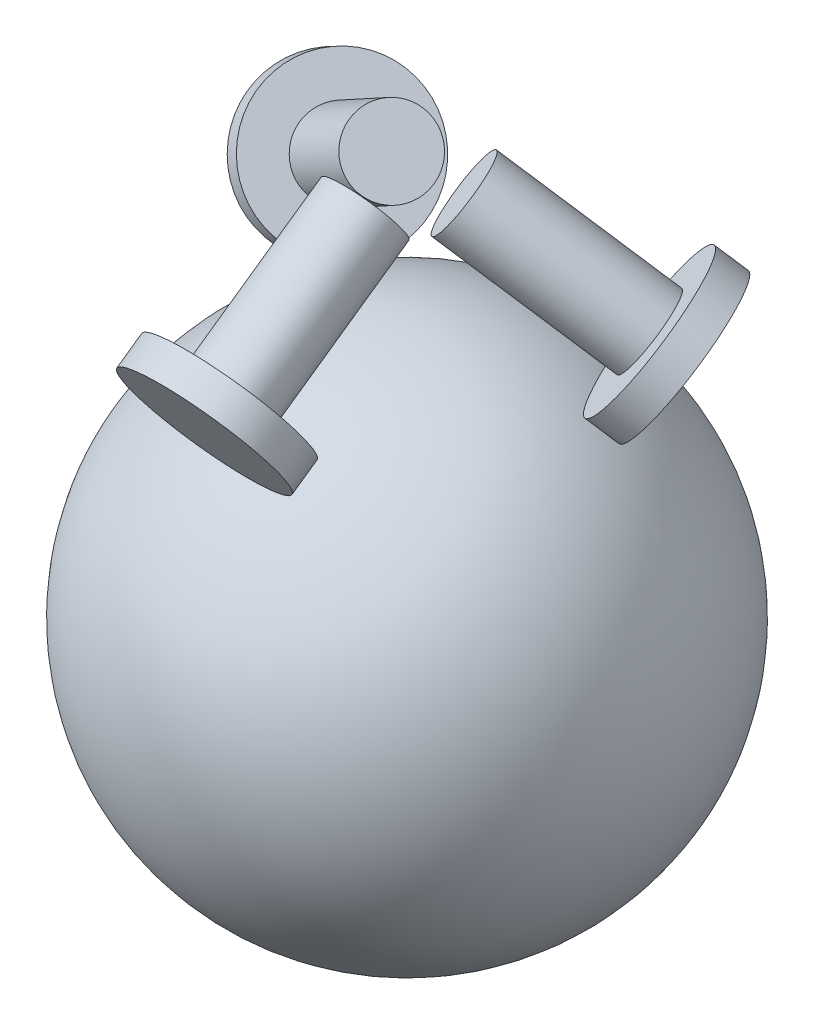
ISO-10303-21;
HEADER;
FILE_DESCRIPTION(('STEP AP214'),'2;1');
FILE_NAME('part.step','',(''),(''),'','','');
FILE_SCHEMA(('AUTOMOTIVE_DESIGN { 1 0 10303 214 1 1 1 1 }'));
ENDSEC;
DATA;
#1=APPLICATION_CONTEXT('core data for automotive mechanical design processes');
#2=APPLICATION_PROTOCOL_DEFINITION('international standard','automotive_design',2000,#1);
#3=PRODUCT_CONTEXT('',#1,'mechanical');
#4=PRODUCT('Part','Part','',(#3));
#5=PRODUCT_RELATED_PRODUCT_CATEGORY('part','',(#4));
#6=PRODUCT_DEFINITION_FORMATION('','',#4);
#7=PRODUCT_DEFINITION_CONTEXT('part definition',#1,'design');
#8=PRODUCT_DEFINITION('design','',#6,#7);
#9=PRODUCT_DEFINITION_SHAPE('','',#8);
#10=(LENGTH_UNIT() NAMED_UNIT(*) SI_UNIT(.MILLI.,.METRE.));
#11=(NAMED_UNIT(*) PLANE_ANGLE_UNIT() SI_UNIT($,.RADIAN.));
#12=(NAMED_UNIT(*) SI_UNIT($,.STERADIAN.) SOLID_ANGLE_UNIT());
#13=UNCERTAINTY_MEASURE_WITH_UNIT(LENGTH_MEASURE(1.E-05),#10,'distance_accuracy_value','');
#14=(GEOMETRIC_REPRESENTATION_CONTEXT(3) GLOBAL_UNCERTAINTY_ASSIGNED_CONTEXT((#13)) GLOBAL_UNIT_ASSIGNED_CONTEXT((#10,
#11,#12)) REPRESENTATION_CONTEXT('',''));
#15=CARTESIAN_POINT('',(0.,0.,0.));
#16=DIRECTION('',(0.,0.,1.));
#17=DIRECTION('',(1.,0.,0.));
#18=AXIS2_PLACEMENT_3D('',#15,#16,#17);
#19=CARTESIAN_POINT('',(-60.3186905564835,109.931224375675,-34.8250122299507));
#20=DIRECTION('',(-0.709406479916224,-0.57357643635105,-0.409576022144488));
#21=DIRECTION('',(0.49673176489216,-0.819152044288989,0.28678821817552));
#22=AXIS2_PLACEMENT_3D('',#19,#20,#21);
#23=CYLINDRICAL_SURFACE('',#22,30.);
#24=CARTESIAN_POINT('',(-60.3186905564835,109.931224375675,-34.8250122299507));
#25=DIRECTION('',(-0.709406479916224,-0.57357643635105,-0.409576022144488));
#26=DIRECTION('',(0.49673176489216,-0.819152044288989,0.28678821817552));
#27=AXIS2_PLACEMENT_3D('',#24,#25,#26);
#28=CIRCLE('',#27,30.);
#29=CARTESIAN_POINT('',(-45.4167376097187,85.3566630470052,-26.2213656846851));
#30=VERTEX_POINT('',#29);
#31=EDGE_CURVE('E11',#30,#30,#28,.T.);
#32=ORIENTED_EDGE('',*,*,#31,.T.);
#33=EDGE_LOOP('',(#32));
#34=FACE_BOUND('',#33,.T.);
#35=CARTESIAN_POINT('',(-68.8315683154781,103.048307139462,-39.7399244956846));
#36=DIRECTION('',(-0.709406479916224,-0.57357643635105,-0.409576022144488));
#37=DIRECTION('',(0.49673176489216,-0.819152044288989,0.28678821817552));
#38=AXIS2_PLACEMENT_3D('',#35,#36,#37);
#39=CIRCLE('',#38,30.);
#40=CARTESIAN_POINT('',(-53.9296153687133,78.4737458107926,-31.136277950419));
#41=VERTEX_POINT('',#40);
#42=EDGE_CURVE('E54',#41,#41,#39,.T.);
#43=ORIENTED_EDGE('',*,*,#42,.F.);
#44=EDGE_LOOP('',(#43));
#45=FACE_BOUND('',#44,.T.);
#46=ADVANCED_FACE('F48',(#34,#45),#23,.T.);
#47=CARTESIAN_POINT('',(-60.3186905564835,109.931224375675,-34.8250122299507));
#48=DIRECTION('',(-0.709406479916224,-0.57357643635105,-0.409576022144488));
#49=DIRECTION('',(0.49673176489216,-0.819152044288989,0.28678821817552));
#50=AXIS2_PLACEMENT_3D('',#47,#48,#49);
#51=PLANE('',#50);
#52=CARTESIAN_POINT('',(-60.3186905568413,109.931224375941,-34.8250122301573));
#53=DIRECTION('',(-0.709406479916224,-0.57357643635105,-0.409576022144488));
#54=DIRECTION('',(0.49673176489216,-0.819152044288989,0.28678821817552));
#55=AXIS2_PLACEMENT_3D('',#52,#53,#54);
#56=CIRCLE('',#55,15.);
#57=CARTESIAN_POINT('',(-52.8677140834589,97.6439437116066,-30.5231889575245));
#58=VERTEX_POINT('',#57);
#59=EDGE_CURVE('E62',#58,#58,#56,.T.);
#60=ORIENTED_EDGE('',*,*,#59,.T.);
#61=EDGE_LOOP('',(#60));
#62=FACE_BOUND('',#61,.T.);
#63=ORIENTED_EDGE('',*,*,#31,.F.);
#64=EDGE_LOOP('',(#63));
#65=FACE_BOUND('',#64,.T.);
#66=ADVANCED_FACE('F68',(#62,#65),#51,.F.);
#67=CARTESIAN_POINT('',(-68.8315683154781,103.048307139462,-39.7399244956846));
#68=DIRECTION('',(-0.709406479916224,-0.57357643635105,-0.409576022144488));
#69=DIRECTION('',(0.49673176489216,-0.819152044288989,0.28678821817552));
#70=AXIS2_PLACEMENT_3D('',#67,#68,#69);
#71=PLANE('',#70);
#72=ORIENTED_EDGE('',*,*,#42,.T.);
#73=EDGE_LOOP('',(#72));
#74=FACE_BOUND('',#73,.T.);
#75=ADVANCED_FACE('F74',(#74),#71,.T.);
#76=CARTESIAN_POINT('',(-14.2072693622868,147.21369273876,-8.2025707907656));
#77=DIRECTION('',(-0.709406479916224,-0.57357643635105,-0.409576022144488));
#78=DIRECTION('',(0.49673176489216,-0.819152044288989,0.28678821817552));
#79=AXIS2_PLACEMENT_3D('',#76,#77,#78);
#80=CYLINDRICAL_SURFACE('',#79,15.);
#81=CARTESIAN_POINT('',(-14.2072693622868,147.21369273876,-8.2025707907656));
#82=DIRECTION('',(-0.709406479916224,-0.57357643635105,-0.409576022144488));
#83=DIRECTION('',(0.49673176489216,-0.819152044288989,0.28678821817552));
#84=AXIS2_PLACEMENT_3D('',#81,#82,#83);
#85=CIRCLE('',#84,15.);
#86=CARTESIAN_POINT('',(-6.75629288890435,134.926412074425,-3.90074751813279));
#87=VERTEX_POINT('',#86);
#88=EDGE_CURVE('E58',#87,#87,#85,.T.);
#89=ORIENTED_EDGE('',*,*,#88,.T.);
#90=EDGE_LOOP('',(#89));
#91=FACE_BOUND('',#90,.T.);
#92=ORIENTED_EDGE('',*,*,#59,.F.);
#93=EDGE_LOOP('',(#92));
#94=FACE_BOUND('',#93,.T.);
#95=ADVANCED_FACE('F71',(#91,#94),#80,.T.);
#96=CARTESIAN_POINT('',(-14.2072693622868,147.21369273876,-8.2025707907656));
#97=DIRECTION('',(-0.709406479916224,-0.57357643635105,-0.409576022144488));
#98=DIRECTION('',(0.49673176489216,-0.819152044288989,0.28678821817552));
#99=AXIS2_PLACEMENT_3D('',#96,#97,#98);
#100=PLANE('',#99);
#101=ORIENTED_EDGE('',*,*,#88,.F.);
#102=EDGE_LOOP('',(#101));
#103=FACE_BOUND('',#102,.T.);
#104=ADVANCED_FACE('F73',(#103),#100,.F.);
#105=CLOSED_SHELL('',(#46,#66,#75,#95,#104));
#106=MANIFOLD_SOLID_BREP('B2',#105);
#107=CARTESIAN_POINT('',(60.318690556483,109.931224375675,-34.8250122299516));
#108=DIRECTION('',(0.709406479916218,-0.57357643635105,-0.409576022144498));
#109=DIRECTION('',(-0.496731764892156,-0.819152044288989,0.286788218175527));
#110=AXIS2_PLACEMENT_3D('',#107,#108,#109);
#111=CYLINDRICAL_SURFACE('',#110,30.);
#112=CARTESIAN_POINT('',(60.318690556483,109.931224375675,-34.8250122299516));
#113=DIRECTION('',(0.709406479916218,-0.57357643635105,-0.409576022144498));
#114=DIRECTION('',(-0.496731764892156,-0.819152044288989,0.286788218175527));
#115=AXIS2_PLACEMENT_3D('',#112,#113,#114);
#116=CIRCLE('',#115,30.);
#117=CARTESIAN_POINT('',(45.4167376097183,85.3566630470052,-26.2213656846858));
#118=VERTEX_POINT('',#117);
#119=EDGE_CURVE('E47',#118,#118,#116,.T.);
#120=ORIENTED_EDGE('',*,*,#119,.T.);
#121=EDGE_LOOP('',(#120));
#122=FACE_BOUND('',#121,.T.);
#123=CARTESIAN_POINT('',(68.8315683154776,103.048307139462,-39.7399244956855));
#124=DIRECTION('',(0.709406479916218,-0.57357643635105,-0.409576022144498));
#125=DIRECTION('',(-0.496731764892156,-0.819152044288989,0.286788218175527));
#126=AXIS2_PLACEMENT_3D('',#123,#124,#125);
#127=CIRCLE('',#126,30.);
#128=CARTESIAN_POINT('',(53.9296153687129,78.4737458107926,-31.1362779504197));
#129=VERTEX_POINT('',#128);
#130=EDGE_CURVE('E133',#129,#129,#127,.T.);
#131=ORIENTED_EDGE('',*,*,#130,.F.);
#132=EDGE_LOOP('',(#131));
#133=FACE_BOUND('',#132,.T.);
#134=ADVANCED_FACE('F127',(#122,#133),#111,.T.);
#135=CARTESIAN_POINT('',(60.318690556483,109.931224375675,-34.8250122299516));
#136=DIRECTION('',(0.709406479916218,-0.57357643635105,-0.409576022144498));
#137=DIRECTION('',(-0.496731764892156,-0.819152044288989,0.286788218175527));
#138=AXIS2_PLACEMENT_3D('',#135,#136,#137);
#139=PLANE('',#138);
#140=CARTESIAN_POINT('',(60.3186905568408,109.931224375941,-34.8250122301582));
#141=DIRECTION('',(0.709406479916218,-0.57357643635105,-0.409576022144498));
#142=DIRECTION('',(-0.496731764892156,-0.819152044288989,0.286788218175527));
#143=AXIS2_PLACEMENT_3D('',#140,#141,#142);
#144=CIRCLE('',#143,15.);
#145=CARTESIAN_POINT('',(52.8677140834585,97.6439437116066,-30.5231889575253));
#146=VERTEX_POINT('',#145);
#147=EDGE_CURVE('E141',#146,#146,#144,.T.);
#148=ORIENTED_EDGE('',*,*,#147,.T.);
#149=EDGE_LOOP('',(#148));
#150=FACE_BOUND('',#149,.T.);
#151=ORIENTED_EDGE('',*,*,#119,.F.);
#152=EDGE_LOOP('',(#151));
#153=FACE_BOUND('',#152,.T.);
#154=ADVANCED_FACE('F147',(#150,#153),#139,.F.);
#155=CARTESIAN_POINT('',(68.8315683154776,103.048307139462,-39.7399244956855));
#156=DIRECTION('',(0.709406479916218,-0.57357643635105,-0.409576022144498));
#157=DIRECTION('',(-0.496731764892156,-0.819152044288989,0.286788218175527));
#158=AXIS2_PLACEMENT_3D('',#155,#156,#157);
#159=PLANE('',#158);
#160=ORIENTED_EDGE('',*,*,#130,.T.);
#161=EDGE_LOOP('',(#160));
#162=FACE_BOUND('',#161,.T.);
#163=ADVANCED_FACE('F153',(#162),#159,.T.);
#164=CARTESIAN_POINT('',(14.2072693622866,147.21369273876,-8.20257079076581));
#165=DIRECTION('',(0.709406479916218,-0.57357643635105,-0.409576022144498));
#166=DIRECTION('',(-0.496731764892156,-0.819152044288989,0.286788218175527));
#167=AXIS2_PLACEMENT_3D('',#164,#165,#166);
#168=CYLINDRICAL_SURFACE('',#167,15.);
#169=CARTESIAN_POINT('',(14.2072693622866,147.21369273876,-8.20257079076581));
#170=DIRECTION('',(0.709406479916218,-0.57357643635105,-0.409576022144498));
#171=DIRECTION('',(-0.496731764892156,-0.819152044288989,0.286788218175527));
#172=AXIS2_PLACEMENT_3D('',#169,#170,#171);
#173=CIRCLE('',#172,15.);
#174=CARTESIAN_POINT('',(6.75629288890429,134.926412074425,-3.9007475181329));
#175=VERTEX_POINT('',#174);
#176=EDGE_CURVE('E137',#175,#175,#173,.T.);
#177=ORIENTED_EDGE('',*,*,#176,.T.);
#178=EDGE_LOOP('',(#177));
#179=FACE_BOUND('',#178,.T.);
#180=ORIENTED_EDGE('',*,*,#147,.F.);
#181=EDGE_LOOP('',(#180));
#182=FACE_BOUND('',#181,.T.);
#183=ADVANCED_FACE('F150',(#179,#182),#168,.T.);
#184=CARTESIAN_POINT('',(14.2072693622866,147.21369273876,-8.20257079076581));
#185=DIRECTION('',(0.709406479916218,-0.57357643635105,-0.409576022144498));
#186=DIRECTION('',(-0.496731764892156,-0.819152044288989,0.286788218175527));
#187=AXIS2_PLACEMENT_3D('',#184,#185,#186);
#188=PLANE('',#187);
#189=ORIENTED_EDGE('',*,*,#176,.F.);
#190=EDGE_LOOP('',(#189));
#191=FACE_BOUND('',#190,.T.);
#192=ADVANCED_FACE('F152',(#191),#188,.F.);
#193=CLOSED_SHELL('',(#134,#154,#163,#183,#192));
#194=MANIFOLD_SOLID_BREP('B6',#193);
#195=CARTESIAN_POINT('',(0.,109.931224375675,69.6500244599026));
#196=DIRECTION('',(0.,-0.57357643635105,0.819152044288989));
#197=DIRECTION('',(0.,-0.819152044288989,-0.57357643635105));
#198=AXIS2_PLACEMENT_3D('',#195,#196,#197);
#199=CYLINDRICAL_SURFACE('',#198,30.);
#200=CARTESIAN_POINT('',(0.,109.931224375675,69.6500244599026));
#201=DIRECTION('',(0.,-0.57357643635105,0.819152044288989));
#202=DIRECTION('',(0.,-0.819152044288989,-0.57357643635105));
#203=AXIS2_PLACEMENT_3D('',#200,#201,#202);
#204=CIRCLE('',#203,30.);
#205=CARTESIAN_POINT('',(0.,85.3566630470052,52.4427313693711));
#206=VERTEX_POINT('',#205);
#207=EDGE_CURVE('E126',#206,#206,#204,.T.);
#208=ORIENTED_EDGE('',*,*,#207,.T.);
#209=EDGE_LOOP('',(#208));
#210=FACE_BOUND('',#209,.T.);
#211=CARTESIAN_POINT('',(0.,103.048307139462,79.4798489913704));
#212=DIRECTION('',(0.,-0.57357643635105,0.819152044288989));
#213=DIRECTION('',(0.,-0.819152044288989,-0.57357643635105));
#214=AXIS2_PLACEMENT_3D('',#211,#212,#213);
#215=CIRCLE('',#214,30.);
#216=CARTESIAN_POINT('',(0.,78.4737458107926,62.2725559008389));
#217=VERTEX_POINT('',#216);
#218=EDGE_CURVE('E209',#217,#217,#215,.T.);
#219=ORIENTED_EDGE('',*,*,#218,.F.);
#220=EDGE_LOOP('',(#219));
#221=FACE_BOUND('',#220,.T.);
#222=ADVANCED_FACE('F203',(#210,#221),#199,.T.);
#223=CARTESIAN_POINT('',(0.,109.931224375675,69.6500244599026));
#224=DIRECTION('',(0.,-0.57357643635105,0.819152044288989));
#225=DIRECTION('',(0.,-0.819152044288989,-0.57357643635105));
#226=AXIS2_PLACEMENT_3D('',#223,#224,#225);
#227=PLANE('',#226);
#228=CARTESIAN_POINT('',(0.,109.931224375941,69.6500244603158));
#229=DIRECTION('',(0.,-0.57357643635105,0.819152044288989));
#230=DIRECTION('',(0.,-0.819152044288989,-0.57357643635105));
#231=AXIS2_PLACEMENT_3D('',#228,#229,#230);
#232=CIRCLE('',#231,15.);
#233=CARTESIAN_POINT('',(0.,97.6439437116066,61.04637791505));
#234=VERTEX_POINT('',#233);
#235=EDGE_CURVE('E217',#234,#234,#232,.T.);
#236=ORIENTED_EDGE('',*,*,#235,.T.);
#237=EDGE_LOOP('',(#236));
#238=FACE_BOUND('',#237,.T.);
#239=ORIENTED_EDGE('',*,*,#207,.F.);
#240=EDGE_LOOP('',(#239));
#241=FACE_BOUND('',#240,.T.);
#242=ADVANCED_FACE('F223',(#238,#241),#227,.F.);
#243=CARTESIAN_POINT('',(0.,103.048307139462,79.4798489913704));
#244=DIRECTION('',(0.,-0.57357643635105,0.819152044288989));
#245=DIRECTION('',(0.,-0.819152044288989,-0.57357643635105));
#246=AXIS2_PLACEMENT_3D('',#243,#244,#245);
#247=PLANE('',#246);
#248=ORIENTED_EDGE('',*,*,#218,.T.);
#249=EDGE_LOOP('',(#248));
#250=FACE_BOUND('',#249,.T.);
#251=ADVANCED_FACE('F229',(#250),#247,.T.);
#252=CARTESIAN_POINT('',(0.,147.21369273876,16.4051415815315));
#253=DIRECTION('',(0.,-0.57357643635105,0.819152044288989));
#254=DIRECTION('',(0.,-0.819152044288989,-0.57357643635105));
#255=AXIS2_PLACEMENT_3D('',#252,#253,#254);
#256=CYLINDRICAL_SURFACE('',#255,15.);
#257=CARTESIAN_POINT('',(0.,147.21369273876,16.4051415815315));
#258=DIRECTION('',(0.,-0.57357643635105,0.819152044288989));
#259=DIRECTION('',(0.,-0.819152044288989,-0.57357643635105));
#260=AXIS2_PLACEMENT_3D('',#257,#258,#259);
#261=CIRCLE('',#260,15.);
#262=CARTESIAN_POINT('',(0.,134.926412074425,7.80149503626572));
#263=VERTEX_POINT('',#262);
#264=EDGE_CURVE('E213',#263,#263,#261,.T.);
#265=ORIENTED_EDGE('',*,*,#264,.T.);
#266=EDGE_LOOP('',(#265));
#267=FACE_BOUND('',#266,.T.);
#268=ORIENTED_EDGE('',*,*,#235,.F.);
#269=EDGE_LOOP('',(#268));
#270=FACE_BOUND('',#269,.T.);
#271=ADVANCED_FACE('F226',(#267,#270),#256,.T.);
#272=CARTESIAN_POINT('',(0.,147.21369273876,16.4051415815315));
#273=DIRECTION('',(0.,-0.57357643635105,0.819152044288989));
#274=DIRECTION('',(0.,-0.819152044288989,-0.57357643635105));
#275=AXIS2_PLACEMENT_3D('',#272,#273,#274);
#276=PLANE('',#275);
#277=ORIENTED_EDGE('',*,*,#264,.F.);
#278=EDGE_LOOP('',(#277));
#279=FACE_BOUND('',#278,.T.);
#280=ADVANCED_FACE('F228',(#279),#276,.F.);
#281=CLOSED_SHELL('',(#222,#242,#251,#271,#280));
#282=MANIFOLD_SOLID_BREP('B42',#281);
#283=CARTESIAN_POINT('',(0.,0.,0.));
#284=DIRECTION('',(1.,0.,0.));
#285=DIRECTION('',(0.,0.,1.));
#286=AXIS2_PLACEMENT_3D('',#283,#284,#285);
#287=SPHERICAL_SURFACE('',#286,100.);
#288=CARTESIAN_POINT('',(100.,0.,0.));
#289=VERTEX_POINT('',#288);
#290=VERTEX_LOOP('',#289);
#291=FACE_BOUND('',#290,.T.);
#292=ADVANCED_FACE('F274',(#291),#287,.T.);
#293=CLOSED_SHELL('',(#292));
#294=MANIFOLD_SOLID_BREP('B121',#293);
#295=ADVANCED_BREP_SHAPE_REPRESENTATION('',(#18,#106,#194,#282,#294),#14);
#296=SHAPE_DEFINITION_REPRESENTATION(#9,#295);
ENDSEC;
END-ISO-10303-21;
